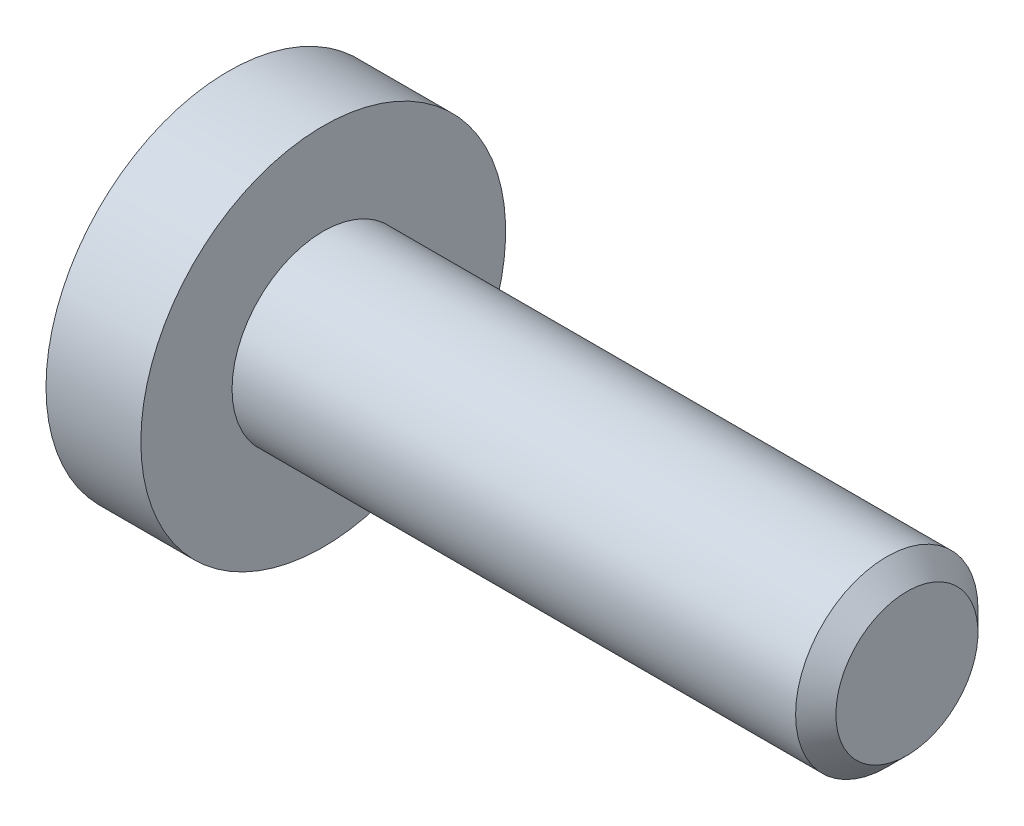
ISO-10303-21;
HEADER;
FILE_DESCRIPTION(('STEP AP214'),'2;1');
FILE_NAME('part.step','',(''),(''),'','','');
FILE_SCHEMA(('AUTOMOTIVE_DESIGN { 1 0 10303 214 1 1 1 1 }'));
ENDSEC;
DATA;
#1=APPLICATION_CONTEXT('core data for automotive mechanical design processes');
#2=APPLICATION_PROTOCOL_DEFINITION('international standard','automotive_design',2000,#1);
#3=PRODUCT_CONTEXT('',#1,'mechanical');
#4=PRODUCT('Part','Part','',(#3));
#5=PRODUCT_RELATED_PRODUCT_CATEGORY('part','',(#4));
#6=PRODUCT_DEFINITION_FORMATION('','',#4);
#7=PRODUCT_DEFINITION_CONTEXT('part definition',#1,'design');
#8=PRODUCT_DEFINITION('design','',#6,#7);
#9=PRODUCT_DEFINITION_SHAPE('','',#8);
#10=(LENGTH_UNIT() NAMED_UNIT(*) SI_UNIT(.MILLI.,.METRE.));
#11=(NAMED_UNIT(*) PLANE_ANGLE_UNIT() SI_UNIT($,.RADIAN.));
#12=(NAMED_UNIT(*) SI_UNIT($,.STERADIAN.) SOLID_ANGLE_UNIT());
#13=UNCERTAINTY_MEASURE_WITH_UNIT(LENGTH_MEASURE(1.E-05),#10,'distance_accuracy_value','');
#14=(GEOMETRIC_REPRESENTATION_CONTEXT(3) GLOBAL_UNCERTAINTY_ASSIGNED_CONTEXT((#13)) GLOBAL_UNIT_ASSIGNED_CONTEXT((#10,
#11,#12)) REPRESENTATION_CONTEXT('',''));
#15=CARTESIAN_POINT('',(0.,0.,0.));
#16=DIRECTION('',(0.,0.,1.));
#17=DIRECTION('',(1.,0.,0.));
#18=AXIS2_PLACEMENT_3D('',#15,#16,#17);
#19=CARTESIAN_POINT('',(-1.1994446500535,0.,0.));
#20=DIRECTION('',(-1.,0.,0.));
#21=DIRECTION('',(0.,-1.,0.));
#22=AXIS2_PLACEMENT_3D('',#19,#20,#21);
#23=CONICAL_SURFACE('',#22,0.65,0.7853981633975);
#24=CARTESIAN_POINT('',(-1.3,0.,0.));
#25=DIRECTION('',(-1.,0.,0.));
#26=DIRECTION('',(0.,-1.,0.));
#27=AXIS2_PLACEMENT_3D('',#24,#25,#26);
#28=CIRCLE('',#27,0.75055534994651);
#29=CARTESIAN_POINT('',(-1.3,0.37527767497326,0.65));
#30=VERTEX_POINT('',#29);
#31=CARTESIAN_POINT('',(-1.3,0.75055534994651,0.));
#32=VERTEX_POINT('',#31);
#33=EDGE_CURVE('E239',#30,#32,#28,.T.);
#34=ORIENTED_EDGE('',*,*,#33,.T.);
#35=CARTESIAN_POINT('',(-1.30011549669667,0.750670820000348,-0.0002));
#36=CARTESIAN_POINT('',(-1.28721736219155,0.737764803996119,0.0221538754426223));
#37=CARTESIAN_POINT('',(-1.27507515489864,0.724643800275742,0.0448801205326159));
#38=CARTESIAN_POINT('',(-1.25284224486223,0.697888312556696,0.0912219846432891));
#39=CARTESIAN_POINT('',(-1.24276392481001,0.684251279339138,0.114842019040605));
#40=CARTESIAN_POINT('',(-1.22550151642338,0.656751052753338,0.162473808706867));
#41=CARTESIAN_POINT('',(-1.21827395851559,0.642894902701991,0.186473364593099));
#42=CARTESIAN_POINT('',(-1.20712920200002,0.61488415068472,0.234989410245225));
#43=CARTESIAN_POINT('',(-1.20320370262188,0.600730389323019,0.259504444041898));
#44=CARTESIAN_POINT('',(-1.19822343733472,0.566158679282889,0.319384402335943));
#45=CARTESIAN_POINT('',(-1.19912448479267,0.545659978891326,0.354889192903263));
#46=CARTESIAN_POINT('',(-1.20840856131669,0.505092254718504,0.425154552318031));
#47=CARTESIAN_POINT('',(-1.21680276302968,0.485023918403302,0.459913930439342));
#48=CARTESIAN_POINT('',(-1.23704567850732,0.449779956850398,0.520958262508976));
#49=CARTESIAN_POINT('',(-1.24783842326453,0.434442301170756,0.547523861415114));
#50=CARTESIAN_POINT('',(-1.27215193144962,0.404367956205622,0.599614154899081));
#51=CARTESIAN_POINT('',(-1.2856638210073,0.389629494831159,0.625141918825043));
#52=CARTESIAN_POINT('',(-1.30011549669668,0.375162204919422,0.6502));
#53=B_SPLINE_CURVE_WITH_KNOTS('',3,(#35,#36,#37,#38,#39,#40,#41,#42,#43,#44,#45,#46,#47,#48,#49,
#50,#51,#52),.UNSPECIFIED.,.F.,.F.,(4,2,2,2,2,2,2,2,4),(0.,0.0866236559063485,0.173752711623251,
0.25949644280358,0.345023980281768,0.467267720550157,0.589694037029383,0.6871113087555,
0.784215671813656),.UNSPECIFIED.);
#54=EDGE_CURVE('E195',#32,#30,#53,.T.);
#55=ORIENTED_EDGE('',*,*,#54,.T.);
#56=EDGE_LOOP('',(#34,#55));
#57=FACE_BOUND('',#56,.T.);
#58=ADVANCED_FACE('F37',(#57),#23,.F.);
#59=CARTESIAN_POINT('',(-1.3,-0.37527767497326,0.65));
#60=VERTEX_POINT('',#59);
#61=EDGE_CURVE('E242',#60,#30,#28,.T.);
#62=ORIENTED_EDGE('',*,*,#61,.T.);
#63=CARTESIAN_POINT('',(-1.56721715071941,-0.78317358427862,0.65));
#64=CARTESIAN_POINT('',(-1.55265934237751,-0.764252207048108,0.65));
#65=CARTESIAN_POINT('',(-1.53823394396833,-0.745229256470787,0.65));
#66=CARTESIAN_POINT('',(-1.50970364201939,-0.70693782115913,0.65));
#67=CARTESIAN_POINT('',(-1.49559881446819,-0.687669279864719,0.65));
#68=CARTESIAN_POINT('',(-1.45364725833808,-0.62914978995113,0.65));
#69=CARTESIAN_POINT('',(-1.42638681328066,-0.589471700187483,0.65));
#70=CARTESIAN_POINT('',(-1.37254104597563,-0.506035280394783,0.65));
#71=CARTESIAN_POINT('',(-1.34610785410646,-0.462177694774442,0.65));
#72=CARTESIAN_POINT('',(-1.29752764531367,-0.372232771962118,0.65));
#73=CARTESIAN_POINT('',(-1.27536615248053,-0.326153651419332,0.65));
#74=CARTESIAN_POINT('',(-1.24824650470383,-0.257304295855186,0.65));
#75=CARTESIAN_POINT('',(-1.24052488431587,-0.235632168210797,0.65));
#76=CARTESIAN_POINT('',(-1.22681348753155,-0.191746894038118,0.65));
#77=CARTESIAN_POINT('',(-1.22082382144167,-0.169533713148319,0.65));
#78=CARTESIAN_POINT('',(-1.20617740018731,-0.103048899129097,0.65));
#79=CARTESIAN_POINT('',(-1.20047170663151,-0.0580527583366005,0.65));
#80=CARTESIAN_POINT('',(-1.19871507654717,0.0301687547963921,0.65));
#81=CARTESIAN_POINT('',(-1.20225313348171,0.073385583455719,0.65));
#82=CARTESIAN_POINT('',(-1.21347440444918,0.137476557315276,0.65));
#83=CARTESIAN_POINT('',(-1.21827455991215,0.158915828827149,0.65));
#84=CARTESIAN_POINT('',(-1.22960611829329,0.201330946064586,0.65));
#85=CARTESIAN_POINT('',(-1.23613742288496,0.22230681803722,0.65));
#86=CARTESIAN_POINT('',(-1.25873421008472,0.286851837633312,0.65));
#87=CARTESIAN_POINT('',(-1.27731075335823,0.329536361572834,0.65));
#88=CARTESIAN_POINT('',(-1.31865287068115,0.412913336322102,0.65));
#89=CARTESIAN_POINT('',(-1.34143320283047,0.453598108757336,0.65));
#90=CARTESIAN_POINT('',(-1.38845664874058,0.531371405705109,0.65));
#91=CARTESIAN_POINT('',(-1.41257228006571,0.568538341315214,0.65));
#92=CARTESIAN_POINT('',(-1.46228009229032,0.641439081313372,0.65));
#93=CARTESIAN_POINT('',(-1.48785876365307,0.677182040955047,0.65));
#94=CARTESIAN_POINT('',(-1.51391268602539,0.712529713353447,0.65));
#95=B_SPLINE_CURVE_WITH_KNOTS('',3,(#63,#64,#65,#66,#67,#68,#69,#70,#71,#72,#73,#74,#75,#76,#77,
#78,#79,#80,#81,#82,#83,#84,#85,#86,#87,#88,#89,#90,#91,#92,#93,#94),.UNSPECIFIED.,.F.,.F.,(4,2,
2,2,2,2,2,2,2,2,2,2,2,2,2,4),(0.,0.0716190798443789,0.143254962956823,0.287616500381499,
0.441121911729925,0.594097608699779,0.663053823301259,0.732014428689813,0.867109958343713,
0.996301964428975,1.0621484141871,1.12799112477356,1.26724409457066,1.40699557125886,
1.53985730268113,1.67164518431192),.UNSPECIFIED.);
#96=EDGE_CURVE('E140',#30,#60,#95,.F.);
#97=ORIENTED_EDGE('',*,*,#96,.T.);
#98=EDGE_LOOP('',(#62,#97));
#99=FACE_BOUND('',#98,.T.);
#100=ADVANCED_FACE('F216',(#99),#23,.F.);
#101=CARTESIAN_POINT('',(-1.3,-0.75055534994651,0.));
#102=VERTEX_POINT('',#101);
#103=EDGE_CURVE('E245',#102,#60,#28,.T.);
#104=ORIENTED_EDGE('',*,*,#103,.T.);
#105=CARTESIAN_POINT('',(-1.30011549669668,-0.375162204919422,0.6502));
#106=CARTESIAN_POINT('',(-1.28721736219155,-0.388068220923652,0.627846124557377));
#107=CARTESIAN_POINT('',(-1.27507515489864,-0.401189224644029,0.605119879467383));
#108=CARTESIAN_POINT('',(-1.25284224486223,-0.427944712363075,0.558778015356709));
#109=CARTESIAN_POINT('',(-1.24276392481001,-0.441581745580634,0.535157980959392));
#110=CARTESIAN_POINT('',(-1.22550151642338,-0.469081972166434,0.487526191293129));
#111=CARTESIAN_POINT('',(-1.21827395851559,-0.482938122217782,0.463526635406896));
#112=CARTESIAN_POINT('',(-1.20712920200002,-0.510948874235053,0.415010589754769));
#113=CARTESIAN_POINT('',(-1.20320370262188,-0.525102635596755,0.390495555958095));
#114=CARTESIAN_POINT('',(-1.19822343733472,-0.559674345636885,0.330615597664049));
#115=CARTESIAN_POINT('',(-1.19912448479267,-0.580173046028449,0.295110807096729));
#116=CARTESIAN_POINT('',(-1.20840856131669,-0.62074077020127,0.224845447681961));
#117=CARTESIAN_POINT('',(-1.21680276302968,-0.640809106516473,0.19008606956065));
#118=CARTESIAN_POINT('',(-1.23704567850732,-0.676053068069375,0.129041737491017));
#119=CARTESIAN_POINT('',(-1.24783842326452,-0.691390723749017,0.102476138584881));
#120=CARTESIAN_POINT('',(-1.27215193144961,-0.721465068714149,0.0503858451009169));
#121=CARTESIAN_POINT('',(-1.2856638210073,-0.736203530088612,0.0248580811749563));
#122=CARTESIAN_POINT('',(-1.30011549669667,-0.750670820000348,-0.000199999999999905));
#123=B_SPLINE_CURVE_WITH_KNOTS('',3,(#105,#106,#107,#108,#109,#110,#111,#112,#113,#114,#115,
#116,#117,#118,#119,#120,#121,#122),.UNSPECIFIED.,.F.,.F.,(4,2,2,2,2,2,2,2,4),(0.,
0.0866236559063509,0.173752711623255,0.259496442803588,0.345023980281778,0.467267720550167,
0.589694037029393,0.687111308755504,0.784215671813655),.UNSPECIFIED.);
#124=EDGE_CURVE('E186',#60,#102,#123,.T.);
#125=ORIENTED_EDGE('',*,*,#124,.T.);
#126=EDGE_LOOP('',(#104,#125));
#127=FACE_BOUND('',#126,.T.);
#128=ADVANCED_FACE('F222',(#127),#23,.F.);
#129=CARTESIAN_POINT('',(-1.3,-0.37527767497326,-0.65));
#130=VERTEX_POINT('',#129);
#131=EDGE_CURVE('E244',#130,#102,#28,.T.);
#132=ORIENTED_EDGE('',*,*,#131,.T.);
#133=CARTESIAN_POINT('',(-1.30011549669667,-0.750670820000348,0.0002));
#134=CARTESIAN_POINT('',(-1.28721736219155,-0.737764803996119,-0.0221538754426223));
#135=CARTESIAN_POINT('',(-1.27507515489864,-0.724643800275742,-0.0448801205326159));
#136=CARTESIAN_POINT('',(-1.25284224486223,-0.697888312556696,-0.0912219846432891));
#137=CARTESIAN_POINT('',(-1.24276392481001,-0.684251279339138,-0.114842019040605));
#138=CARTESIAN_POINT('',(-1.22550151642338,-0.656751052753338,-0.162473808706867));
#139=CARTESIAN_POINT('',(-1.21827395851559,-0.642894902701991,-0.186473364593099));
#140=CARTESIAN_POINT('',(-1.20712920200002,-0.61488415068472,-0.234989410245225));
#141=CARTESIAN_POINT('',(-1.20320370262188,-0.600730389323019,-0.259504444041898));
#142=CARTESIAN_POINT('',(-1.19822343733472,-0.566158679282889,-0.319384402335943));
#143=CARTESIAN_POINT('',(-1.19912448479267,-0.545659978891326,-0.354889192903263));
#144=CARTESIAN_POINT('',(-1.20840856131669,-0.505092254718504,-0.425154552318031));
#145=CARTESIAN_POINT('',(-1.21680276302968,-0.485023918403302,-0.459913930439342));
#146=CARTESIAN_POINT('',(-1.23704567850732,-0.449779956850398,-0.520958262508976));
#147=CARTESIAN_POINT('',(-1.24783842326453,-0.434442301170756,-0.547523861415114));
#148=CARTESIAN_POINT('',(-1.27215193144962,-0.404367956205622,-0.599614154899081));
#149=CARTESIAN_POINT('',(-1.2856638210073,-0.389629494831159,-0.625141918825043));
#150=CARTESIAN_POINT('',(-1.30011549669668,-0.375162204919422,-0.6502));
#151=B_SPLINE_CURVE_WITH_KNOTS('',3,(#133,#134,#135,#136,#137,#138,#139,#140,#141,#142,#143,
#144,#145,#146,#147,#148,#149,#150),.UNSPECIFIED.,.F.,.F.,(4,2,2,2,2,2,2,2,4),(0.,
0.0866236559063485,0.173752711623251,0.25949644280358,0.345023980281768,0.467267720550157,
0.589694037029383,0.6871113087555,0.784215671813656),.UNSPECIFIED.);
#152=EDGE_CURVE('E181',#102,#130,#151,.T.);
#153=ORIENTED_EDGE('',*,*,#152,.T.);
#154=EDGE_LOOP('',(#132,#153));
#155=FACE_BOUND('',#154,.T.);
#156=ADVANCED_FACE('F233',(#155),#23,.F.);
#157=CARTESIAN_POINT('',(-1.3,0.37527767497326,-0.65));
#158=VERTEX_POINT('',#157);
#159=EDGE_CURVE('E240',#158,#130,#28,.T.);
#160=ORIENTED_EDGE('',*,*,#159,.T.);
#161=CARTESIAN_POINT('',(-1.56721715071941,-0.78317358427862,-0.65));
#162=CARTESIAN_POINT('',(-1.55265934237751,-0.764252207048108,-0.65));
#163=CARTESIAN_POINT('',(-1.53823394396833,-0.745229256470787,-0.65));
#164=CARTESIAN_POINT('',(-1.50970364201939,-0.70693782115913,-0.65));
#165=CARTESIAN_POINT('',(-1.49559881446819,-0.687669279864719,-0.65));
#166=CARTESIAN_POINT('',(-1.45364725833808,-0.62914978995113,-0.65));
#167=CARTESIAN_POINT('',(-1.42638681328066,-0.589471700187483,-0.65));
#168=CARTESIAN_POINT('',(-1.37254104597563,-0.506035280394783,-0.65));
#169=CARTESIAN_POINT('',(-1.34610785410646,-0.462177694774442,-0.65));
#170=CARTESIAN_POINT('',(-1.29752764531367,-0.372232771962118,-0.65));
#171=CARTESIAN_POINT('',(-1.27536615248053,-0.326153651419332,-0.65));
#172=CARTESIAN_POINT('',(-1.24824650470383,-0.257304295855186,-0.65));
#173=CARTESIAN_POINT('',(-1.24052488431587,-0.235632168210797,-0.65));
#174=CARTESIAN_POINT('',(-1.22681348753155,-0.191746894038118,-0.65));
#175=CARTESIAN_POINT('',(-1.22082382144167,-0.169533713148319,-0.65));
#176=CARTESIAN_POINT('',(-1.20617740018731,-0.103048899129097,-0.65));
#177=CARTESIAN_POINT('',(-1.20047170663151,-0.0580527583366005,-0.65));
#178=CARTESIAN_POINT('',(-1.19871507654717,0.0301687547963921,-0.65));
#179=CARTESIAN_POINT('',(-1.20225313348171,0.073385583455719,-0.65));
#180=CARTESIAN_POINT('',(-1.21347440444918,0.137476557315276,-0.65));
#181=CARTESIAN_POINT('',(-1.21827455991215,0.158915828827149,-0.65));
#182=CARTESIAN_POINT('',(-1.22960611829329,0.201330946064586,-0.65));
#183=CARTESIAN_POINT('',(-1.23613742288496,0.22230681803722,-0.65));
#184=CARTESIAN_POINT('',(-1.25873421008472,0.286851837633312,-0.65));
#185=CARTESIAN_POINT('',(-1.27731075335823,0.329536361572834,-0.65));
#186=CARTESIAN_POINT('',(-1.31865287068115,0.412913336322102,-0.65));
#187=CARTESIAN_POINT('',(-1.34143320283047,0.453598108757336,-0.65));
#188=CARTESIAN_POINT('',(-1.38845664874058,0.531371405705109,-0.65));
#189=CARTESIAN_POINT('',(-1.41257228006571,0.568538341315214,-0.65));
#190=CARTESIAN_POINT('',(-1.46228009229032,0.641439081313372,-0.65));
#191=CARTESIAN_POINT('',(-1.48785876365307,0.677182040955047,-0.65));
#192=CARTESIAN_POINT('',(-1.51391268602539,0.712529713353447,-0.65));
#193=B_SPLINE_CURVE_WITH_KNOTS('',3,(#161,#162,#163,#164,#165,#166,#167,#168,#169,#170,#171,
#172,#173,#174,#175,#176,#177,#178,#179,#180,#181,#182,#183,#184,#185,#186,#187,#188,#189,#190,
#191,#192),.UNSPECIFIED.,.F.,.F.,(4,2,2,2,2,2,2,2,2,2,2,2,2,2,2,4),(0.,0.0716190798443789,
0.143254962956823,0.287616500381499,0.441121911729925,0.594097608699779,0.663053823301259,
0.732014428689813,0.867109958343713,0.996301964428975,1.0621484141871,1.12799112477356,
1.26724409457066,1.40699557125886,1.53985730268113,1.67164518431192),.UNSPECIFIED.);
#194=EDGE_CURVE('E143',#130,#158,#193,.T.);
#195=ORIENTED_EDGE('',*,*,#194,.T.);
#196=EDGE_LOOP('',(#160,#195));
#197=FACE_BOUND('',#196,.T.);
#198=ADVANCED_FACE('F226',(#197),#23,.F.);
#199=EDGE_CURVE('E236',#32,#158,#28,.T.);
#200=ORIENTED_EDGE('',*,*,#199,.T.);
#201=CARTESIAN_POINT('',(-1.30011549669668,0.375162204919422,-0.6502));
#202=CARTESIAN_POINT('',(-1.28721736219155,0.388068220923652,-0.627846124557377));
#203=CARTESIAN_POINT('',(-1.27507515489864,0.401189224644029,-0.605119879467383));
#204=CARTESIAN_POINT('',(-1.25284224486223,0.427944712363075,-0.558778015356709));
#205=CARTESIAN_POINT('',(-1.24276392481001,0.441581745580634,-0.535157980959392));
#206=CARTESIAN_POINT('',(-1.22550151642338,0.469081972166434,-0.487526191293129));
#207=CARTESIAN_POINT('',(-1.21827395851559,0.482938122217782,-0.463526635406896));
#208=CARTESIAN_POINT('',(-1.20712920200002,0.510948874235053,-0.415010589754769));
#209=CARTESIAN_POINT('',(-1.20320370262188,0.525102635596755,-0.390495555958095));
#210=CARTESIAN_POINT('',(-1.19822343733472,0.559674345636885,-0.330615597664049));
#211=CARTESIAN_POINT('',(-1.19912448479267,0.580173046028449,-0.295110807096729));
#212=CARTESIAN_POINT('',(-1.20840856131669,0.62074077020127,-0.224845447681961));
#213=CARTESIAN_POINT('',(-1.21680276302968,0.640809106516473,-0.19008606956065));
#214=CARTESIAN_POINT('',(-1.23704567850732,0.676053068069375,-0.129041737491017));
#215=CARTESIAN_POINT('',(-1.24783842326452,0.691390723749017,-0.102476138584881));
#216=CARTESIAN_POINT('',(-1.27215193144961,0.721465068714149,-0.050385845100917));
#217=CARTESIAN_POINT('',(-1.2856638210073,0.736203530088612,-0.0248580811749564));
#218=CARTESIAN_POINT('',(-1.30011549669667,0.750670820000348,0.000199999999999905));
#219=B_SPLINE_CURVE_WITH_KNOTS('',3,(#201,#202,#203,#204,#205,#206,#207,#208,#209,#210,#211,
#212,#213,#214,#215,#216,#217,#218),.UNSPECIFIED.,.F.,.F.,(4,2,2,2,2,2,2,2,4),(0.,
0.0866236559063509,0.173752711623255,0.259496442803588,0.345023980281778,0.467267720550167,
0.589694037029393,0.687111308755504,0.784215671813655),.UNSPECIFIED.);
#220=EDGE_CURVE('E51',#158,#32,#219,.T.);
#221=ORIENTED_EDGE('',*,*,#220,.T.);
#222=EDGE_LOOP('',(#200,#221));
#223=FACE_BOUND('',#222,.T.);
#224=ADVANCED_FACE('F218',(#223),#23,.F.);
#225=CARTESIAN_POINT('',(-1.3,0.,0.));
#226=DIRECTION('',(1.,0.,0.));
#227=DIRECTION('',(0.,0.,-1.));
#228=AXIS2_PLACEMENT_3D('',#225,#226,#227);
#229=PLANE('',#228);
#230=CARTESIAN_POINT('',(-1.3,0.,0.));
#231=DIRECTION('',(-1.,0.,0.));
#232=DIRECTION('',(0.,0.,1.));
#233=AXIS2_PLACEMENT_3D('',#230,#231,#232);
#234=CIRCLE('',#233,2.5);
#235=CARTESIAN_POINT('',(-1.3,0.,2.5));
#236=VERTEX_POINT('',#235);
#237=EDGE_CURVE('E11',#236,#236,#234,.T.);
#238=ORIENTED_EDGE('',*,*,#237,.T.);
#239=EDGE_LOOP('',(#238));
#240=FACE_BOUND('',#239,.T.);
#241=ORIENTED_EDGE('',*,*,#103,.F.);
#242=ORIENTED_EDGE('',*,*,#131,.F.);
#243=ORIENTED_EDGE('',*,*,#159,.F.);
#244=ORIENTED_EDGE('',*,*,#199,.F.);
#245=ORIENTED_EDGE('',*,*,#33,.F.);
#246=ORIENTED_EDGE('',*,*,#61,.F.);
#247=EDGE_LOOP('',(#241,#242,#243,#244,#245,#246));
#248=FACE_BOUND('',#247,.T.);
#249=ADVANCED_FACE('F39',(#240,#248),#229,.F.);
#250=CARTESIAN_POINT('',(8.,0.,0.));
#251=DIRECTION('',(-1.,0.,0.));
#252=DIRECTION('',(0.,0.,1.));
#253=AXIS2_PLACEMENT_3D('',#250,#251,#252);
#254=CYLINDRICAL_SURFACE('',#253,2.5);
#255=ORIENTED_EDGE('',*,*,#237,.F.);
#256=EDGE_LOOP('',(#255));
#257=FACE_BOUND('',#256,.T.);
#258=CARTESIAN_POINT('',(0.,0.,0.));
#259=DIRECTION('',(-1.,0.,0.));
#260=DIRECTION('',(0.,0.,1.));
#261=AXIS2_PLACEMENT_3D('',#258,#259,#260);
#262=CIRCLE('',#261,2.5);
#263=CARTESIAN_POINT('',(0.,0.,2.5));
#264=VERTEX_POINT('',#263);
#265=EDGE_CURVE('E45',#264,#264,#262,.T.);
#266=ORIENTED_EDGE('',*,*,#265,.T.);
#267=EDGE_LOOP('',(#266));
#268=FACE_BOUND('',#267,.T.);
#269=ADVANCED_FACE('F231',(#257,#268),#254,.T.);
#270=CARTESIAN_POINT('',(0.,0.,-2.5));
#271=DIRECTION('',(-1.,0.,0.));
#272=DIRECTION('',(0.,0.,1.));
#273=AXIS2_PLACEMENT_3D('',#270,#271,#272);
#274=PLANE('',#273);
#275=ORIENTED_EDGE('',*,*,#265,.F.);
#276=EDGE_LOOP('',(#275));
#277=FACE_BOUND('',#276,.T.);
#278=CARTESIAN_POINT('',(0.,0.,0.));
#279=DIRECTION('',(-1.,0.,0.));
#280=DIRECTION('',(0.,0.,1.));
#281=AXIS2_PLACEMENT_3D('',#278,#279,#280);
#282=CIRCLE('',#281,1.25);
#283=CARTESIAN_POINT('',(0.,0.,1.25));
#284=VERTEX_POINT('',#283);
#285=EDGE_CURVE('E255',#284,#284,#282,.T.);
#286=ORIENTED_EDGE('',*,*,#285,.T.);
#287=EDGE_LOOP('',(#286));
#288=FACE_BOUND('',#287,.T.);
#289=ADVANCED_FACE('F261',(#277,#288),#274,.F.);
#290=CARTESIAN_POINT('',(8.,0.,0.));
#291=DIRECTION('',(-1.,0.,0.));
#292=DIRECTION('',(0.,0.,1.));
#293=AXIS2_PLACEMENT_3D('',#290,#291,#292);
#294=CYLINDRICAL_SURFACE('',#293,1.25);
#295=ORIENTED_EDGE('',*,*,#285,.F.);
#296=EDGE_LOOP('',(#295));
#297=FACE_BOUND('',#296,.T.);
#298=CARTESIAN_POINT('',(7.724,0.,0.));
#299=DIRECTION('',(-1.,0.,0.));
#300=DIRECTION('',(0.,0.,1.));
#301=AXIS2_PLACEMENT_3D('',#298,#299,#300);
#302=CIRCLE('',#301,1.25);
#303=CARTESIAN_POINT('',(7.724,0.,1.25));
#304=VERTEX_POINT('',#303);
#305=EDGE_CURVE('E252',#304,#304,#302,.T.);
#306=ORIENTED_EDGE('',*,*,#305,.T.);
#307=EDGE_LOOP('',(#306));
#308=FACE_BOUND('',#307,.T.);
#309=ADVANCED_FACE('F264',(#297,#308),#294,.T.);
#310=CARTESIAN_POINT('',(8.,0.,0.));
#311=DIRECTION('',(-1.,0.,0.));
#312=DIRECTION('',(0.,0.,1.));
#313=AXIS2_PLACEMENT_3D('',#310,#311,#312);
#314=CONICAL_SURFACE('',#313,0.974,0.785398163397448);
#315=ORIENTED_EDGE('',*,*,#305,.F.);
#316=EDGE_LOOP('',(#315));
#317=FACE_BOUND('',#316,.T.);
#318=CARTESIAN_POINT('',(8.,0.,0.));
#319=DIRECTION('',(-1.,0.,0.));
#320=DIRECTION('',(0.,0.,1.));
#321=AXIS2_PLACEMENT_3D('',#318,#319,#320);
#322=CIRCLE('',#321,0.974);
#323=CARTESIAN_POINT('',(8.,0.,0.974));
#324=VERTEX_POINT('',#323);
#325=EDGE_CURVE('E248',#324,#324,#322,.T.);
#326=ORIENTED_EDGE('',*,*,#325,.T.);
#327=EDGE_LOOP('',(#326));
#328=FACE_BOUND('',#327,.T.);
#329=ADVANCED_FACE('F270',(#317,#328),#314,.T.);
#330=CARTESIAN_POINT('',(8.,0.,-0.974));
#331=DIRECTION('',(-1.,0.,0.));
#332=DIRECTION('',(0.,0.,1.));
#333=AXIS2_PLACEMENT_3D('',#330,#331,#332);
#334=PLANE('',#333);
#335=ORIENTED_EDGE('',*,*,#325,.F.);
#336=EDGE_LOOP('',(#335));
#337=FACE_BOUND('',#336,.T.);
#338=ADVANCED_FACE('F205',(#337),#334,.F.);
#339=CARTESIAN_POINT('',(0.2,0.75055534994651,0.));
#340=DIRECTION('',(0.,-0.866025403784442,-0.499999999999993));
#341=DIRECTION('',(0.,0.499999999999993,-0.866025403784442));
#342=AXIS2_PLACEMENT_3D('',#339,#340,#341);
#343=PLANE('',#342);
#344=DIRECTION('',(-1.,0.,0.));
#345=VECTOR('',#344,1.);
#346=CARTESIAN_POINT('',(0.2,0.75055534994651,0.));
#347=LINE('',#346,#345);
#348=CARTESIAN_POINT('',(0.2,0.75055534994651,0.));
#349=VERTEX_POINT('',#348);
#350=EDGE_CURVE('E312',#349,#32,#347,.T.);
#351=ORIENTED_EDGE('',*,*,#350,.F.);
#352=DIRECTION('',(0.,-0.499999999999993,0.866025403784442));
#353=VECTOR('',#352,1.);
#354=CARTESIAN_POINT('',(0.2,0.75055534994651,0.));
#355=LINE('',#354,#353);
#356=CARTESIAN_POINT('',(0.2,0.562916512459887,0.324999999999996));
#357=VERTEX_POINT('',#356);
#358=EDGE_CURVE('E123',#349,#357,#355,.T.);
#359=ORIENTED_EDGE('',*,*,#358,.T.);
#360=CARTESIAN_POINT('',(0.2,0.37527767497326,0.65));
#361=VERTEX_POINT('',#360);
#362=EDGE_CURVE('E114',#357,#361,#355,.T.);
#363=ORIENTED_EDGE('',*,*,#362,.T.);
#364=DIRECTION('',(-1.,0.,0.));
#365=VECTOR('',#364,1.);
#366=CARTESIAN_POINT('',(0.2,0.37527767497326,0.65));
#367=LINE('',#366,#365);
#368=EDGE_CURVE('E120',#361,#30,#367,.T.);
#369=ORIENTED_EDGE('',*,*,#368,.T.);
#370=ORIENTED_EDGE('',*,*,#54,.F.);
#371=EDGE_LOOP('',(#351,#359,#363,#369,#370));
#372=FACE_BOUND('',#371,.T.);
#373=ADVANCED_FACE('F117',(#372),#343,.T.);
#374=CARTESIAN_POINT('',(0.2,0.37527767497326,0.65));
#375=DIRECTION('',(0.,0.,-1.));
#376=DIRECTION('',(-1.,0.,0.));
#377=AXIS2_PLACEMENT_3D('',#374,#375,#376);
#378=PLANE('',#377);
#379=ORIENTED_EDGE('',*,*,#368,.F.);
#380=DIRECTION('',(0.,-1.,0.));
#381=VECTOR('',#380,1.);
#382=CARTESIAN_POINT('',(0.2,0.37527767497326,0.65));
#383=LINE('',#382,#381);
#384=CARTESIAN_POINT('',(0.2,0.,0.65));
#385=VERTEX_POINT('',#384);
#386=EDGE_CURVE('E128',#361,#385,#383,.T.);
#387=ORIENTED_EDGE('',*,*,#386,.T.);
#388=CARTESIAN_POINT('',(0.2,-0.37527767497326,0.65));
#389=VERTEX_POINT('',#388);
#390=EDGE_CURVE('E135',#385,#389,#383,.T.);
#391=ORIENTED_EDGE('',*,*,#390,.T.);
#392=DIRECTION('',(-1.,0.,0.));
#393=VECTOR('',#392,1.);
#394=CARTESIAN_POINT('',(0.2,-0.37527767497326,0.65));
#395=LINE('',#394,#393);
#396=EDGE_CURVE('E141',#389,#60,#395,.T.);
#397=ORIENTED_EDGE('',*,*,#396,.T.);
#398=ORIENTED_EDGE('',*,*,#96,.F.);
#399=EDGE_LOOP('',(#379,#387,#391,#397,#398));
#400=FACE_BOUND('',#399,.T.);
#401=ADVANCED_FACE('F138',(#400),#378,.T.);
#402=CARTESIAN_POINT('',(0.2,-0.37527767497326,0.65));
#403=DIRECTION('',(0.,0.866025403784442,-0.499999999999993));
#404=DIRECTION('',(0.,0.499999999999993,0.866025403784442));
#405=AXIS2_PLACEMENT_3D('',#402,#403,#404);
#406=PLANE('',#405);
#407=ORIENTED_EDGE('',*,*,#396,.F.);
#408=DIRECTION('',(0.,-0.499999999999993,-0.866025403784442));
#409=VECTOR('',#408,1.);
#410=CARTESIAN_POINT('',(0.2,-0.37527767497326,0.65));
#411=LINE('',#410,#409);
#412=CARTESIAN_POINT('',(0.2,-0.562916512459887,0.324999999999996));
#413=VERTEX_POINT('',#412);
#414=EDGE_CURVE('E323',#389,#413,#411,.T.);
#415=ORIENTED_EDGE('',*,*,#414,.T.);
#416=CARTESIAN_POINT('',(0.2,-0.75055534994651,0.));
#417=VERTEX_POINT('',#416);
#418=EDGE_CURVE('E134',#413,#417,#411,.T.);
#419=ORIENTED_EDGE('',*,*,#418,.T.);
#420=DIRECTION('',(-1.,0.,0.));
#421=VECTOR('',#420,1.);
#422=CARTESIAN_POINT('',(0.2,-0.75055534994651,0.));
#423=LINE('',#422,#421);
#424=EDGE_CURVE('E145',#417,#102,#423,.T.);
#425=ORIENTED_EDGE('',*,*,#424,.T.);
#426=ORIENTED_EDGE('',*,*,#124,.F.);
#427=EDGE_LOOP('',(#407,#415,#419,#425,#426));
#428=FACE_BOUND('',#427,.T.);
#429=ADVANCED_FACE('F178',(#428),#406,.T.);
#430=CARTESIAN_POINT('',(0.2,-0.75055534994651,0.));
#431=DIRECTION('',(0.,0.866025403784442,0.499999999999993));
#432=DIRECTION('',(0.,-0.499999999999993,0.866025403784442));
#433=AXIS2_PLACEMENT_3D('',#430,#431,#432);
#434=PLANE('',#433);
#435=ORIENTED_EDGE('',*,*,#424,.F.);
#436=DIRECTION('',(0.,0.499999999999993,-0.866025403784442));
#437=VECTOR('',#436,1.);
#438=CARTESIAN_POINT('',(0.2,-0.75055534994651,0.));
#439=LINE('',#438,#437);
#440=CARTESIAN_POINT('',(0.2,-0.562916512459888,-0.324999999999996));
#441=VERTEX_POINT('',#440);
#442=EDGE_CURVE('E59',#417,#441,#439,.T.);
#443=ORIENTED_EDGE('',*,*,#442,.T.);
#444=CARTESIAN_POINT('',(0.2,-0.37527767497326,-0.65));
#445=VERTEX_POINT('',#444);
#446=EDGE_CURVE('E325',#441,#445,#439,.T.);
#447=ORIENTED_EDGE('',*,*,#446,.T.);
#448=DIRECTION('',(-1.,0.,0.));
#449=VECTOR('',#448,1.);
#450=CARTESIAN_POINT('',(0.2,-0.37527767497326,-0.65));
#451=LINE('',#450,#449);
#452=EDGE_CURVE('E300',#445,#130,#451,.T.);
#453=ORIENTED_EDGE('',*,*,#452,.T.);
#454=ORIENTED_EDGE('',*,*,#152,.F.);
#455=EDGE_LOOP('',(#435,#443,#447,#453,#454));
#456=FACE_BOUND('',#455,.T.);
#457=ADVANCED_FACE('F173',(#456),#434,.T.);
#458=CARTESIAN_POINT('',(0.2,-0.37527767497326,-0.65));
#459=DIRECTION('',(0.,0.,1.));
#460=DIRECTION('',(1.,0.,0.));
#461=AXIS2_PLACEMENT_3D('',#458,#459,#460);
#462=PLANE('',#461);
#463=ORIENTED_EDGE('',*,*,#452,.F.);
#464=DIRECTION('',(0.,1.,0.));
#465=VECTOR('',#464,1.);
#466=CARTESIAN_POINT('',(0.2,-0.37527767497326,-0.65));
#467=LINE('',#466,#465);
#468=CARTESIAN_POINT('',(0.2,0.,-0.65));
#469=VERTEX_POINT('',#468);
#470=EDGE_CURVE('E328',#445,#469,#467,.T.);
#471=ORIENTED_EDGE('',*,*,#470,.T.);
#472=CARTESIAN_POINT('',(0.2,0.37527767497326,-0.65));
#473=VERTEX_POINT('',#472);
#474=EDGE_CURVE('E327',#469,#473,#467,.T.);
#475=ORIENTED_EDGE('',*,*,#474,.T.);
#476=DIRECTION('',(-1.,0.,0.));
#477=VECTOR('',#476,1.);
#478=CARTESIAN_POINT('',(0.2,0.37527767497326,-0.65));
#479=LINE('',#478,#477);
#480=EDGE_CURVE('E313',#473,#158,#479,.T.);
#481=ORIENTED_EDGE('',*,*,#480,.T.);
#482=ORIENTED_EDGE('',*,*,#194,.F.);
#483=EDGE_LOOP('',(#463,#471,#475,#481,#482));
#484=FACE_BOUND('',#483,.T.);
#485=ADVANCED_FACE('F167',(#484),#462,.T.);
#486=CARTESIAN_POINT('',(0.2,0.37527767497326,-0.65));
#487=DIRECTION('',(0.,-0.866025403784442,0.499999999999993));
#488=DIRECTION('',(0.,-0.499999999999993,-0.866025403784442));
#489=AXIS2_PLACEMENT_3D('',#486,#487,#488);
#490=PLANE('',#489);
#491=ORIENTED_EDGE('',*,*,#480,.F.);
#492=DIRECTION('',(0.,0.499999999999993,0.866025403784442));
#493=VECTOR('',#492,1.);
#494=CARTESIAN_POINT('',(0.2,0.37527767497326,-0.65));
#495=LINE('',#494,#493);
#496=CARTESIAN_POINT('',(0.2,0.562916512459887,-0.324999999999996));
#497=VERTEX_POINT('',#496);
#498=EDGE_CURVE('E314',#473,#497,#495,.T.);
#499=ORIENTED_EDGE('',*,*,#498,.T.);
#500=EDGE_CURVE('E319',#497,#349,#495,.T.);
#501=ORIENTED_EDGE('',*,*,#500,.T.);
#502=ORIENTED_EDGE('',*,*,#350,.T.);
#503=ORIENTED_EDGE('',*,*,#220,.F.);
#504=EDGE_LOOP('',(#491,#499,#501,#502,#503));
#505=FACE_BOUND('',#504,.T.);
#506=ADVANCED_FACE('F162',(#505),#490,.T.);
#507=CARTESIAN_POINT('',(0.2,0.,0.));
#508=DIRECTION('',(1.,0.,0.));
#509=DIRECTION('',(0.,0.,-1.));
#510=AXIS2_PLACEMENT_3D('',#507,#508,#509);
#511=PLANE('',#510);
#512=CARTESIAN_POINT('',(0.2,0.,0.));
#513=DIRECTION('',(-1.,0.,0.));
#514=DIRECTION('',(0.,-1.,0.));
#515=AXIS2_PLACEMENT_3D('',#512,#513,#514);
#516=CIRCLE('',#515,0.65);
#517=EDGE_CURVE('E311',#497,#469,#516,.T.);
#518=ORIENTED_EDGE('',*,*,#517,.F.);
#519=ORIENTED_EDGE('',*,*,#498,.F.);
#520=ORIENTED_EDGE('',*,*,#474,.F.);
#521=EDGE_LOOP('',(#518,#519,#520));
#522=FACE_BOUND('',#521,.T.);
#523=ADVANCED_FACE('F166',(#522),#511,.F.);
#524=EDGE_CURVE('E307',#357,#497,#516,.T.);
#525=ORIENTED_EDGE('',*,*,#524,.F.);
#526=ORIENTED_EDGE('',*,*,#358,.F.);
#527=ORIENTED_EDGE('',*,*,#500,.F.);
#528=EDGE_LOOP('',(#525,#526,#527));
#529=FACE_BOUND('',#528,.T.);
#530=ADVANCED_FACE('F318',(#529),#511,.F.);
#531=EDGE_CURVE('E130',#385,#357,#516,.T.);
#532=ORIENTED_EDGE('',*,*,#531,.F.);
#533=ORIENTED_EDGE('',*,*,#386,.F.);
#534=ORIENTED_EDGE('',*,*,#362,.F.);
#535=EDGE_LOOP('',(#532,#533,#534));
#536=FACE_BOUND('',#535,.T.);
#537=ADVANCED_FACE('F129',(#536),#511,.F.);
#538=EDGE_CURVE('E249',#413,#385,#516,.T.);
#539=ORIENTED_EDGE('',*,*,#538,.F.);
#540=ORIENTED_EDGE('',*,*,#414,.F.);
#541=ORIENTED_EDGE('',*,*,#390,.F.);
#542=EDGE_LOOP('',(#539,#540,#541));
#543=FACE_BOUND('',#542,.T.);
#544=ADVANCED_FACE('F343',(#543),#511,.F.);
#545=EDGE_CURVE('E305',#441,#413,#516,.T.);
#546=ORIENTED_EDGE('',*,*,#545,.F.);
#547=ORIENTED_EDGE('',*,*,#442,.F.);
#548=ORIENTED_EDGE('',*,*,#418,.F.);
#549=EDGE_LOOP('',(#546,#547,#548));
#550=FACE_BOUND('',#549,.T.);
#551=ADVANCED_FACE('F212',(#550),#511,.F.);
#552=EDGE_CURVE('E308',#469,#441,#516,.T.);
#553=ORIENTED_EDGE('',*,*,#552,.F.);
#554=ORIENTED_EDGE('',*,*,#470,.F.);
#555=ORIENTED_EDGE('',*,*,#446,.F.);
#556=EDGE_LOOP('',(#553,#554,#555));
#557=FACE_BOUND('',#556,.T.);
#558=ADVANCED_FACE('F169',(#557),#511,.F.);
#559=CARTESIAN_POINT('',(0.57527767497326,0.,0.));
#560=DIRECTION('',(-1.,0.,0.));
#561=DIRECTION('',(0.,-1.,0.));
#562=AXIS2_PLACEMENT_3D('',#559,#560,#561);
#563=CONICAL_SURFACE('',#562,0.,1.04719755119659);
#564=ORIENTED_EDGE('',*,*,#538,.T.);
#565=ORIENTED_EDGE('',*,*,#531,.T.);
#566=ORIENTED_EDGE('',*,*,#524,.T.);
#567=ORIENTED_EDGE('',*,*,#517,.T.);
#568=ORIENTED_EDGE('',*,*,#552,.T.);
#569=ORIENTED_EDGE('',*,*,#545,.T.);
#570=EDGE_LOOP('',(#564,#565,#566,#567,#568,#569));
#571=FACE_BOUND('',#570,.T.);
#572=CARTESIAN_POINT('',(0.57527767497326,0.,0.));
#573=VERTEX_POINT('',#572);
#574=VERTEX_LOOP('',#573);
#575=FACE_BOUND('',#574,.T.);
#576=ADVANCED_FACE('F206',(#571,#575),#563,.F.);
#577=CLOSED_SHELL('',(#58,#100,#128,#156,#198,#224,#249,#269,#289,#309,#329,#338,#373,#401,#429,
#457,#485,#506,#523,#530,#537,#544,#551,#558,#576));
#578=MANIFOLD_SOLID_BREP('B2',#577);
#579=ADVANCED_BREP_SHAPE_REPRESENTATION('',(#18,#578),#14);
#580=SHAPE_DEFINITION_REPRESENTATION(#9,#579);
ENDSEC;
END-ISO-10303-21;
